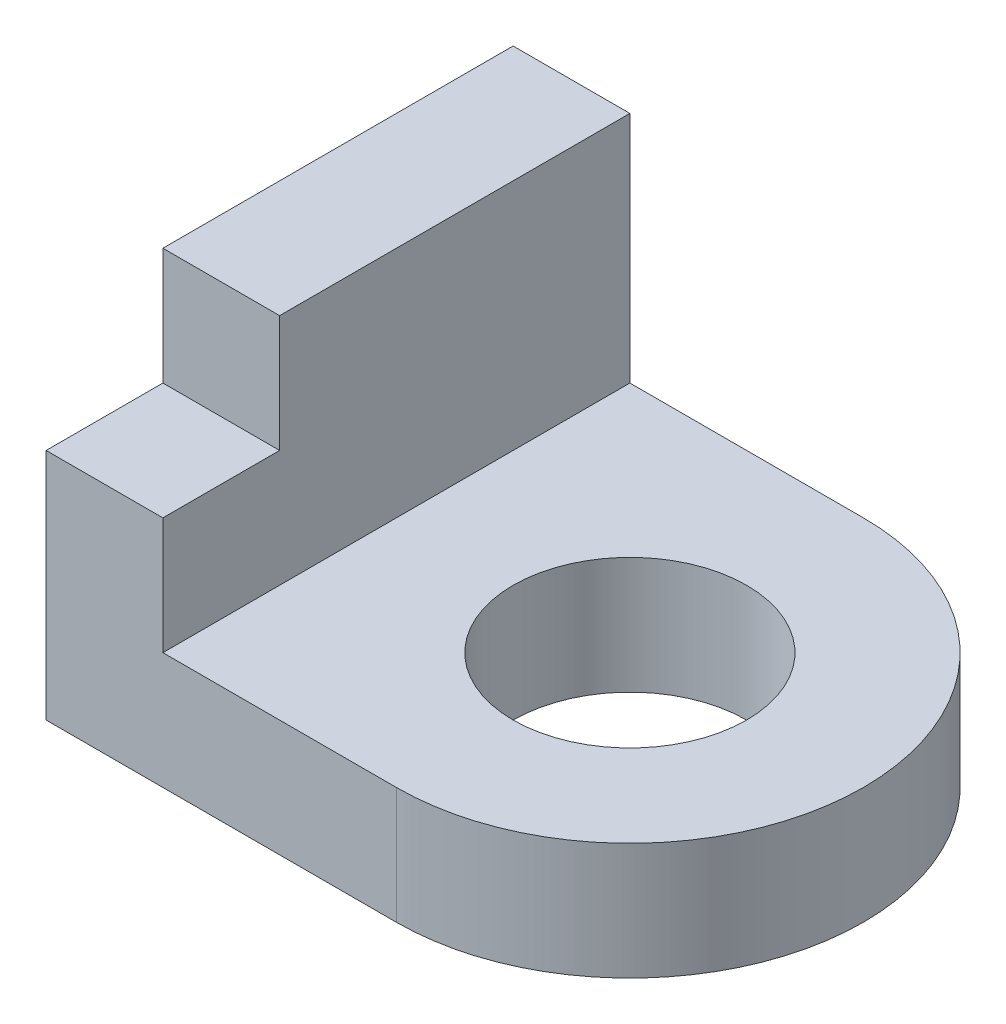
ISO-10303-21;
HEADER;
FILE_DESCRIPTION(('STEP AP214'),'2;1');
FILE_NAME('part.step','',(''),(''),'','','');
FILE_SCHEMA(('AUTOMOTIVE_DESIGN { 1 0 10303 214 1 1 1 1 }'));
ENDSEC;
DATA;
#1=APPLICATION_CONTEXT('core data for automotive mechanical design processes');
#2=APPLICATION_PROTOCOL_DEFINITION('international standard','automotive_design',2000,#1);
#3=PRODUCT_CONTEXT('',#1,'mechanical');
#4=PRODUCT('Part','Part','',(#3));
#5=PRODUCT_RELATED_PRODUCT_CATEGORY('part','',(#4));
#6=PRODUCT_DEFINITION_FORMATION('','',#4);
#7=PRODUCT_DEFINITION_CONTEXT('part definition',#1,'design');
#8=PRODUCT_DEFINITION('design','',#6,#7);
#9=PRODUCT_DEFINITION_SHAPE('','',#8);
#10=(LENGTH_UNIT() NAMED_UNIT(*) SI_UNIT(.MILLI.,.METRE.));
#11=(NAMED_UNIT(*) PLANE_ANGLE_UNIT() SI_UNIT($,.RADIAN.));
#12=(NAMED_UNIT(*) SI_UNIT($,.STERADIAN.) SOLID_ANGLE_UNIT());
#13=UNCERTAINTY_MEASURE_WITH_UNIT(LENGTH_MEASURE(1.E-05),#10,'distance_accuracy_value','');
#14=(GEOMETRIC_REPRESENTATION_CONTEXT(3) GLOBAL_UNCERTAINTY_ASSIGNED_CONTEXT((#13)) GLOBAL_UNIT_ASSIGNED_CONTEXT((#10,
#11,#12)) REPRESENTATION_CONTEXT('',''));
#15=CARTESIAN_POINT('',(0.,0.,0.));
#16=DIRECTION('',(0.,0.,1.));
#17=DIRECTION('',(1.,0.,0.));
#18=AXIS2_PLACEMENT_3D('',#15,#16,#17);
#19=CARTESIAN_POINT('',(0.,5.,10.));
#20=DIRECTION('',(0.,0.,1.));
#21=DIRECTION('',(1.,0.,0.));
#22=AXIS2_PLACEMENT_3D('',#19,#20,#21);
#23=PLANE('',#22);
#24=DIRECTION('',(-1.,0.,0.));
#25=VECTOR('',#24,1.);
#26=CARTESIAN_POINT('',(0.,0.,10.));
#27=LINE('',#26,#25);
#28=CARTESIAN_POINT('',(0.,0.,10.));
#29=VERTEX_POINT('',#28);
#30=CARTESIAN_POINT('',(-15.,0.,10.));
#31=VERTEX_POINT('',#30);
#32=EDGE_CURVE('E112',#29,#31,#27,.T.);
#33=ORIENTED_EDGE('',*,*,#32,.F.);
#34=DIRECTION('',(0.,-1.,0.));
#35=VECTOR('',#34,1.);
#36=CARTESIAN_POINT('',(0.,5.,10.));
#37=LINE('',#36,#35);
#38=CARTESIAN_POINT('',(0.,5.,10.));
#39=VERTEX_POINT('',#38);
#40=EDGE_CURVE('E11',#39,#29,#37,.T.);
#41=ORIENTED_EDGE('',*,*,#40,.F.);
#42=DIRECTION('',(-1.,0.,0.));
#43=VECTOR('',#42,1.);
#44=CARTESIAN_POINT('',(0.,5.,10.));
#45=LINE('',#44,#43);
#46=CARTESIAN_POINT('',(-10.,5.,10.));
#47=VERTEX_POINT('',#46);
#48=EDGE_CURVE('E102',#39,#47,#45,.T.);
#49=ORIENTED_EDGE('',*,*,#48,.T.);
#50=DIRECTION('',(0.,-1.,0.));
#51=VECTOR('',#50,1.);
#52=CARTESIAN_POINT('',(-10.,10.,10.));
#53=LINE('',#52,#51);
#54=CARTESIAN_POINT('',(-10.,10.,10.));
#55=VERTEX_POINT('',#54);
#56=EDGE_CURVE('E116',#55,#47,#53,.T.);
#57=ORIENTED_EDGE('',*,*,#56,.F.);
#58=DIRECTION('',(-1.,0.,0.));
#59=VECTOR('',#58,1.);
#60=CARTESIAN_POINT('',(0.,10.,10.));
#61=LINE('',#60,#59);
#62=CARTESIAN_POINT('',(-15.,10.,10.));
#63=VERTEX_POINT('',#62);
#64=EDGE_CURVE('E129',#55,#63,#61,.T.);
#65=ORIENTED_EDGE('',*,*,#64,.T.);
#66=DIRECTION('',(0.,-1.,0.));
#67=VECTOR('',#66,1.);
#68=CARTESIAN_POINT('',(-15.,10.,10.));
#69=LINE('',#68,#67);
#70=EDGE_CURVE('E123',#63,#31,#69,.T.);
#71=ORIENTED_EDGE('',*,*,#70,.T.);
#72=EDGE_LOOP('',(#33,#41,#49,#57,#65,#71));
#73=FACE_BOUND('',#72,.T.);
#74=ADVANCED_FACE('F39',(#73),#23,.T.);
#75=CARTESIAN_POINT('',(0.,5.,0.));
#76=DIRECTION('',(0.,-1.,0.));
#77=DIRECTION('',(0.,0.,-1.));
#78=AXIS2_PLACEMENT_3D('',#75,#76,#77);
#79=CYLINDRICAL_SURFACE('',#78,10.);
#80=CARTESIAN_POINT('',(0.,0.,0.));
#81=DIRECTION('',(0.,1.,0.));
#82=DIRECTION('',(0.,0.,1.));
#83=AXIS2_PLACEMENT_3D('',#80,#81,#82);
#84=CIRCLE('',#83,10.);
#85=CARTESIAN_POINT('',(0.,0.,-10.));
#86=VERTEX_POINT('',#85);
#87=EDGE_CURVE('E105',#29,#86,#84,.T.);
#88=ORIENTED_EDGE('',*,*,#87,.T.);
#89=DIRECTION('',(0.,-1.,0.));
#90=VECTOR('',#89,1.);
#91=CARTESIAN_POINT('',(0.,5.,-10.));
#92=LINE('',#91,#90);
#93=CARTESIAN_POINT('',(0.,5.,-10.));
#94=VERTEX_POINT('',#93);
#95=EDGE_CURVE('E48',#94,#86,#92,.T.);
#96=ORIENTED_EDGE('',*,*,#95,.F.);
#97=CARTESIAN_POINT('',(0.,5.,0.));
#98=DIRECTION('',(0.,1.,0.));
#99=DIRECTION('',(0.,0.,1.));
#100=AXIS2_PLACEMENT_3D('',#97,#98,#99);
#101=CIRCLE('',#100,10.);
#102=EDGE_CURVE('E99',#39,#94,#101,.T.);
#103=ORIENTED_EDGE('',*,*,#102,.F.);
#104=ORIENTED_EDGE('',*,*,#40,.T.);
#105=EDGE_LOOP('',(#88,#96,#103,#104));
#106=FACE_BOUND('',#105,.T.);
#107=ADVANCED_FACE('F104',(#106),#79,.T.);
#108=CARTESIAN_POINT('',(0.,5.,-10.));
#109=DIRECTION('',(0.,0.,1.));
#110=DIRECTION('',(1.,0.,0.));
#111=AXIS2_PLACEMENT_3D('',#108,#109,#110);
#112=PLANE('',#111);
#113=DIRECTION('',(-1.,0.,0.));
#114=VECTOR('',#113,1.);
#115=CARTESIAN_POINT('',(0.,0.,-10.));
#116=LINE('',#115,#114);
#117=CARTESIAN_POINT('',(-15.,0.,-10.));
#118=VERTEX_POINT('',#117);
#119=EDGE_CURVE('E108',#86,#118,#116,.T.);
#120=ORIENTED_EDGE('',*,*,#119,.T.);
#121=DIRECTION('',(0.,-1.,0.));
#122=VECTOR('',#121,1.);
#123=CARTESIAN_POINT('',(-15.,15.,-10.));
#124=LINE('',#123,#122);
#125=CARTESIAN_POINT('',(-15.,15.,-10.));
#126=VERTEX_POINT('',#125);
#127=EDGE_CURVE('E140',#126,#118,#124,.T.);
#128=ORIENTED_EDGE('',*,*,#127,.F.);
#129=DIRECTION('',(-1.,0.,0.));
#130=VECTOR('',#129,1.);
#131=CARTESIAN_POINT('',(0.,15.,-10.));
#132=LINE('',#131,#130);
#133=CARTESIAN_POINT('',(-10.,15.,-10.));
#134=VERTEX_POINT('',#133);
#135=EDGE_CURVE('E155',#134,#126,#132,.T.);
#136=ORIENTED_EDGE('',*,*,#135,.F.);
#137=DIRECTION('',(0.,-1.,0.));
#138=VECTOR('',#137,1.);
#139=CARTESIAN_POINT('',(-10.,15.,-10.));
#140=LINE('',#139,#138);
#141=CARTESIAN_POINT('',(-10.,5.,-10.));
#142=VERTEX_POINT('',#141);
#143=EDGE_CURVE('E98',#134,#142,#140,.T.);
#144=ORIENTED_EDGE('',*,*,#143,.T.);
#145=DIRECTION('',(-1.,0.,0.));
#146=VECTOR('',#145,1.);
#147=CARTESIAN_POINT('',(0.,5.,-10.));
#148=LINE('',#147,#146);
#149=EDGE_CURVE('E91',#94,#142,#148,.T.);
#150=ORIENTED_EDGE('',*,*,#149,.F.);
#151=ORIENTED_EDGE('',*,*,#95,.T.);
#152=EDGE_LOOP('',(#120,#128,#136,#144,#150,#151));
#153=FACE_BOUND('',#152,.T.);
#154=ADVANCED_FACE('F94',(#153),#112,.F.);
#155=CARTESIAN_POINT('',(0.,5.,0.));
#156=DIRECTION('',(0.,-1.,0.));
#157=DIRECTION('',(0.,0.,-1.));
#158=AXIS2_PLACEMENT_3D('',#155,#156,#157);
#159=CYLINDRICAL_SURFACE('',#158,5.);
#160=CARTESIAN_POINT('',(0.,5.,0.));
#161=DIRECTION('',(0.,1.,0.));
#162=DIRECTION('',(0.,0.,1.));
#163=AXIS2_PLACEMENT_3D('',#160,#161,#162);
#164=CIRCLE('',#163,5.);
#165=CARTESIAN_POINT('',(0.,5.,5.));
#166=VERTEX_POINT('',#165);
#167=EDGE_CURVE('E110',#166,#166,#164,.T.);
#168=ORIENTED_EDGE('',*,*,#167,.T.);
#169=EDGE_LOOP('',(#168));
#170=FACE_BOUND('',#169,.T.);
#171=CARTESIAN_POINT('',(0.,0.,0.));
#172=DIRECTION('',(0.,1.,0.));
#173=DIRECTION('',(0.,0.,1.));
#174=AXIS2_PLACEMENT_3D('',#171,#172,#173);
#175=CIRCLE('',#174,5.);
#176=CARTESIAN_POINT('',(0.,0.,5.));
#177=VERTEX_POINT('',#176);
#178=EDGE_CURVE('E114',#177,#177,#175,.T.);
#179=ORIENTED_EDGE('',*,*,#178,.F.);
#180=EDGE_LOOP('',(#179));
#181=FACE_BOUND('',#180,.T.);
#182=ADVANCED_FACE('F41',(#170,#181),#159,.F.);
#183=CARTESIAN_POINT('',(0.,5.,0.));
#184=DIRECTION('',(0.,1.,0.));
#185=DIRECTION('',(0.,0.,1.));
#186=AXIS2_PLACEMENT_3D('',#183,#184,#185);
#187=PLANE('',#186);
#188=ORIENTED_EDGE('',*,*,#167,.F.);
#189=EDGE_LOOP('',(#188));
#190=FACE_BOUND('',#189,.T.);
#191=ORIENTED_EDGE('',*,*,#48,.F.);
#192=ORIENTED_EDGE('',*,*,#102,.T.);
#193=ORIENTED_EDGE('',*,*,#149,.T.);
#194=DIRECTION('',(0.,0.,1.));
#195=VECTOR('',#194,1.);
#196=CARTESIAN_POINT('',(-9.99999999999999,5.,0.));
#197=LINE('',#196,#195);
#198=EDGE_CURVE('E56',#142,#47,#197,.T.);
#199=ORIENTED_EDGE('',*,*,#198,.T.);
#200=EDGE_LOOP('',(#191,#192,#193,#199));
#201=FACE_BOUND('',#200,.T.);
#202=ADVANCED_FACE('F101',(#190,#201),#187,.T.);
#203=CARTESIAN_POINT('',(0.,0.,0.));
#204=DIRECTION('',(0.,1.,0.));
#205=DIRECTION('',(0.,0.,1.));
#206=AXIS2_PLACEMENT_3D('',#203,#204,#205);
#207=PLANE('',#206);
#208=ORIENTED_EDGE('',*,*,#178,.T.);
#209=EDGE_LOOP('',(#208));
#210=FACE_BOUND('',#209,.T.);
#211=ORIENTED_EDGE('',*,*,#32,.T.);
#212=DIRECTION('',(0.,0.,1.));
#213=VECTOR('',#212,1.);
#214=CARTESIAN_POINT('',(-15.,0.,0.));
#215=LINE('',#214,#213);
#216=EDGE_CURVE('E126',#118,#31,#215,.T.);
#217=ORIENTED_EDGE('',*,*,#216,.F.);
#218=ORIENTED_EDGE('',*,*,#119,.F.);
#219=ORIENTED_EDGE('',*,*,#87,.F.);
#220=EDGE_LOOP('',(#211,#217,#218,#219));
#221=FACE_BOUND('',#220,.T.);
#222=ADVANCED_FACE('F204',(#210,#221),#207,.F.);
#223=CARTESIAN_POINT('',(-9.99999999999999,10.,0.));
#224=DIRECTION('',(-1.,0.,0.));
#225=DIRECTION('',(0.,0.,1.));
#226=AXIS2_PLACEMENT_3D('',#223,#224,#225);
#227=PLANE('',#226);
#228=ORIENTED_EDGE('',*,*,#56,.T.);
#229=ORIENTED_EDGE('',*,*,#198,.F.);
#230=ORIENTED_EDGE('',*,*,#143,.F.);
#231=DIRECTION('',(0.,0.,1.));
#232=VECTOR('',#231,1.);
#233=CARTESIAN_POINT('',(-9.99999999999999,15.,0.));
#234=LINE('',#233,#232);
#235=CARTESIAN_POINT('',(-9.99999999999999,15.,5.));
#236=VERTEX_POINT('',#235);
#237=EDGE_CURVE('E158',#134,#236,#234,.T.);
#238=ORIENTED_EDGE('',*,*,#237,.T.);
#239=DIRECTION('',(0.,-1.,0.));
#240=VECTOR('',#239,1.);
#241=CARTESIAN_POINT('',(-9.99999999999999,15.,5.));
#242=LINE('',#241,#240);
#243=CARTESIAN_POINT('',(-9.99999999999999,10.,5.));
#244=VERTEX_POINT('',#243);
#245=EDGE_CURVE('E146',#236,#244,#242,.T.);
#246=ORIENTED_EDGE('',*,*,#245,.T.);
#247=DIRECTION('',(0.,0.,-1.));
#248=VECTOR('',#247,1.);
#249=CARTESIAN_POINT('',(-9.99999999999999,10.,0.));
#250=LINE('',#249,#248);
#251=EDGE_CURVE('E134',#55,#244,#250,.T.);
#252=ORIENTED_EDGE('',*,*,#251,.F.);
#253=EDGE_LOOP('',(#228,#229,#230,#238,#246,#252));
#254=FACE_BOUND('',#253,.T.);
#255=ADVANCED_FACE('F163',(#254),#227,.F.);
#256=CARTESIAN_POINT('',(-15.,10.,0.));
#257=DIRECTION('',(1.,0.,0.));
#258=DIRECTION('',(0.,0.,-1.));
#259=AXIS2_PLACEMENT_3D('',#256,#257,#258);
#260=PLANE('',#259);
#261=ORIENTED_EDGE('',*,*,#216,.T.);
#262=ORIENTED_EDGE('',*,*,#70,.F.);
#263=DIRECTION('',(0.,0.,1.));
#264=VECTOR('',#263,1.);
#265=CARTESIAN_POINT('',(-15.,10.,0.));
#266=LINE('',#265,#264);
#267=CARTESIAN_POINT('',(-15.,10.,5.));
#268=VERTEX_POINT('',#267);
#269=EDGE_CURVE('E77',#268,#63,#266,.T.);
#270=ORIENTED_EDGE('',*,*,#269,.F.);
#271=DIRECTION('',(0.,-1.,0.));
#272=VECTOR('',#271,1.);
#273=CARTESIAN_POINT('',(-15.,15.,5.));
#274=LINE('',#273,#272);
#275=CARTESIAN_POINT('',(-15.,15.,5.));
#276=VERTEX_POINT('',#275);
#277=EDGE_CURVE('E143',#276,#268,#274,.T.);
#278=ORIENTED_EDGE('',*,*,#277,.F.);
#279=DIRECTION('',(0.,0.,1.));
#280=VECTOR('',#279,1.);
#281=CARTESIAN_POINT('',(-15.,15.,0.));
#282=LINE('',#281,#280);
#283=EDGE_CURVE('E152',#126,#276,#282,.T.);
#284=ORIENTED_EDGE('',*,*,#283,.F.);
#285=ORIENTED_EDGE('',*,*,#127,.T.);
#286=EDGE_LOOP('',(#261,#262,#270,#278,#284,#285));
#287=FACE_BOUND('',#286,.T.);
#288=ADVANCED_FACE('F186',(#287),#260,.F.);
#289=CARTESIAN_POINT('',(0.,10.,0.));
#290=DIRECTION('',(0.,1.,0.));
#291=DIRECTION('',(0.,0.,1.));
#292=AXIS2_PLACEMENT_3D('',#289,#290,#291);
#293=PLANE('',#292);
#294=ORIENTED_EDGE('',*,*,#64,.F.);
#295=ORIENTED_EDGE('',*,*,#251,.T.);
#296=DIRECTION('',(1.,0.,0.));
#297=VECTOR('',#296,1.);
#298=CARTESIAN_POINT('',(0.,10.,5.));
#299=LINE('',#298,#297);
#300=EDGE_CURVE('E131',#268,#244,#299,.T.);
#301=ORIENTED_EDGE('',*,*,#300,.F.);
#302=ORIENTED_EDGE('',*,*,#269,.T.);
#303=EDGE_LOOP('',(#294,#295,#301,#302));
#304=FACE_BOUND('',#303,.T.);
#305=ADVANCED_FACE('F183',(#304),#293,.T.);
#306=CARTESIAN_POINT('',(0.,15.,5.));
#307=DIRECTION('',(0.,0.,-1.));
#308=DIRECTION('',(-1.,0.,0.));
#309=AXIS2_PLACEMENT_3D('',#306,#307,#308);
#310=PLANE('',#309);
#311=ORIENTED_EDGE('',*,*,#300,.T.);
#312=ORIENTED_EDGE('',*,*,#245,.F.);
#313=DIRECTION('',(1.,0.,0.));
#314=VECTOR('',#313,1.);
#315=CARTESIAN_POINT('',(0.,15.,5.));
#316=LINE('',#315,#314);
#317=EDGE_CURVE('E149',#276,#236,#316,.T.);
#318=ORIENTED_EDGE('',*,*,#317,.F.);
#319=ORIENTED_EDGE('',*,*,#277,.T.);
#320=EDGE_LOOP('',(#311,#312,#318,#319));
#321=FACE_BOUND('',#320,.T.);
#322=ADVANCED_FACE('F185',(#321),#310,.F.);
#323=CARTESIAN_POINT('',(0.,15.,0.));
#324=DIRECTION('',(0.,1.,0.));
#325=DIRECTION('',(0.,0.,1.));
#326=AXIS2_PLACEMENT_3D('',#323,#324,#325);
#327=PLANE('',#326);
#328=ORIENTED_EDGE('',*,*,#237,.F.);
#329=ORIENTED_EDGE('',*,*,#135,.T.);
#330=ORIENTED_EDGE('',*,*,#283,.T.);
#331=ORIENTED_EDGE('',*,*,#317,.T.);
#332=EDGE_LOOP('',(#328,#329,#330,#331));
#333=FACE_BOUND('',#332,.T.);
#334=ADVANCED_FACE('F170',(#333),#327,.T.);
#335=CLOSED_SHELL('',(#74,#107,#154,#182,#202,#222,#255,#288,#305,#322,#334));
#336=MANIFOLD_SOLID_BREP('B2',#335);
#337=ADVANCED_BREP_SHAPE_REPRESENTATION('',(#18,#336),#14);
#338=SHAPE_DEFINITION_REPRESENTATION(#9,#337);
ENDSEC;
END-ISO-10303-21;
